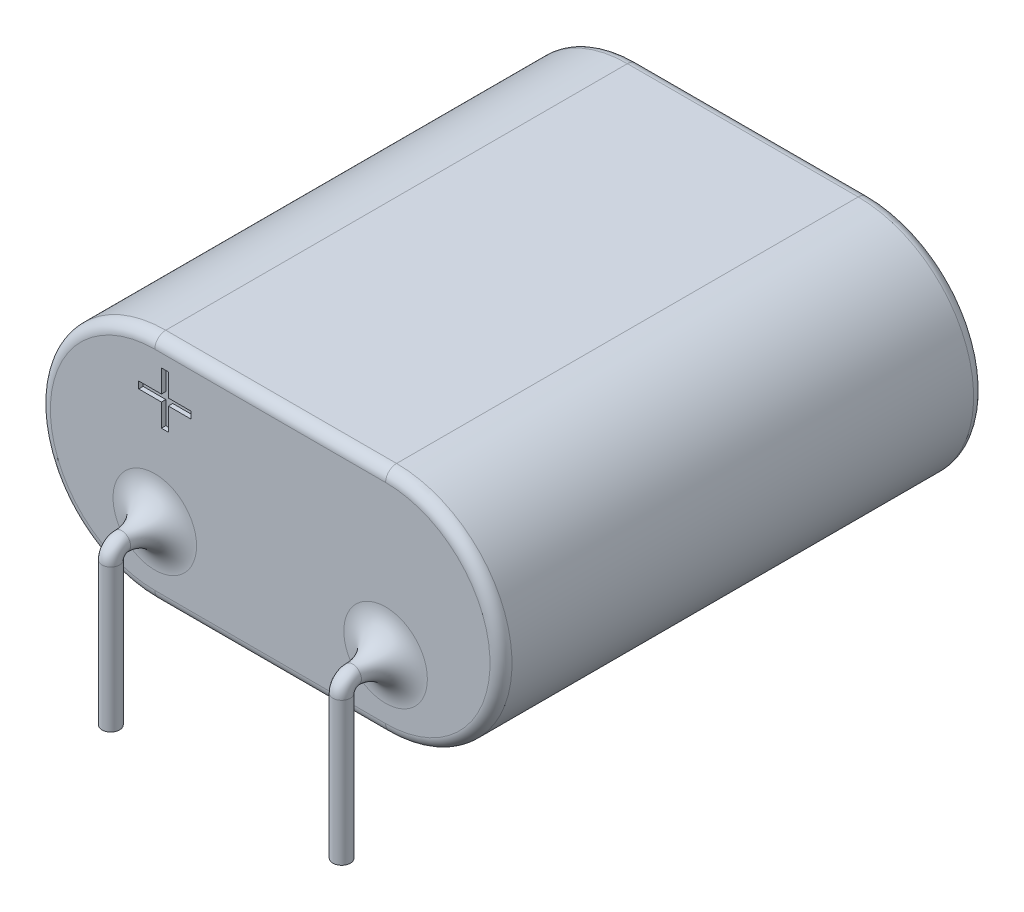
ISO-10303-21;
HEADER;
FILE_DESCRIPTION(('STEP AP214'),'2;1');
FILE_NAME('part.step','',(''),(''),'','','');
FILE_SCHEMA(('AUTOMOTIVE_DESIGN { 1 0 10303 214 1 1 1 1 }'));
ENDSEC;
DATA;
#1=APPLICATION_CONTEXT('core data for automotive mechanical design processes');
#2=APPLICATION_PROTOCOL_DEFINITION('international standard','automotive_design',2000,#1);
#3=PRODUCT_CONTEXT('',#1,'mechanical');
#4=PRODUCT('Part','Part','',(#3));
#5=PRODUCT_RELATED_PRODUCT_CATEGORY('part','',(#4));
#6=PRODUCT_DEFINITION_FORMATION('','',#4);
#7=PRODUCT_DEFINITION_CONTEXT('part definition',#1,'design');
#8=PRODUCT_DEFINITION('design','',#6,#7);
#9=PRODUCT_DEFINITION_SHAPE('','',#8);
#10=(LENGTH_UNIT() NAMED_UNIT(*) SI_UNIT(.MILLI.,.METRE.));
#11=(NAMED_UNIT(*) PLANE_ANGLE_UNIT() SI_UNIT($,.RADIAN.));
#12=(NAMED_UNIT(*) SI_UNIT($,.STERADIAN.) SOLID_ANGLE_UNIT());
#13=UNCERTAINTY_MEASURE_WITH_UNIT(LENGTH_MEASURE(1.E-05),#10,'distance_accuracy_value','');
#14=(GEOMETRIC_REPRESENTATION_CONTEXT(3) GLOBAL_UNCERTAINTY_ASSIGNED_CONTEXT((#13)) GLOBAL_UNIT_ASSIGNED_CONTEXT((#10,
#11,#12)) REPRESENTATION_CONTEXT('',''));
#15=CARTESIAN_POINT('',(0.,0.,0.));
#16=DIRECTION('',(0.,0.,1.));
#17=DIRECTION('',(1.,0.,0.));
#18=AXIS2_PLACEMENT_3D('',#15,#16,#17);
#19=CARTESIAN_POINT('',(0.,0.,0.));
#20=DIRECTION('',(0.,0.,1.));
#21=DIRECTION('',(1.,0.,0.));
#22=AXIS2_PLACEMENT_3D('',#19,#20,#21);
#23=PLANE('',#22);
#24=CARTESIAN_POINT('',(10.5,0.,0.));
#25=DIRECTION('',(0.,0.,1.));
#26=DIRECTION('',(1.,0.,0.));
#27=AXIS2_PLACEMENT_3D('',#24,#25,#26);
#28=CIRCLE('',#27,4.75);
#29=CARTESIAN_POINT('',(10.5,-4.75,0.));
#30=VERTEX_POINT('',#29);
#31=CARTESIAN_POINT('',(10.5,4.75,0.));
#32=VERTEX_POINT('',#31);
#33=EDGE_CURVE('E51',#30,#32,#28,.T.);
#34=ORIENTED_EDGE('',*,*,#33,.T.);
#35=DIRECTION('',(-1.,0.,0.));
#36=VECTOR('',#35,1.);
#37=CARTESIAN_POINT('',(0.,4.75,0.));
#38=LINE('',#37,#36);
#39=CARTESIAN_POINT('',(0.,4.75,0.));
#40=VERTEX_POINT('',#39);
#41=EDGE_CURVE('E11',#32,#40,#38,.T.);
#42=ORIENTED_EDGE('',*,*,#41,.T.);
#43=CARTESIAN_POINT('',(0.,0.,0.));
#44=DIRECTION('',(0.,0.,1.));
#45=DIRECTION('',(1.,0.,0.));
#46=AXIS2_PLACEMENT_3D('',#43,#44,#45);
#47=CIRCLE('',#46,4.75);
#48=CARTESIAN_POINT('',(0.,-4.75,0.));
#49=VERTEX_POINT('',#48);
#50=EDGE_CURVE('E303',#40,#49,#47,.T.);
#51=ORIENTED_EDGE('',*,*,#50,.T.);
#52=DIRECTION('',(1.,0.,0.));
#53=VECTOR('',#52,1.);
#54=CARTESIAN_POINT('',(0.,-4.75,0.));
#55=LINE('',#54,#53);
#56=EDGE_CURVE('E306',#49,#30,#55,.T.);
#57=ORIENTED_EDGE('',*,*,#56,.T.);
#58=EDGE_LOOP('',(#34,#42,#51,#57));
#59=FACE_BOUND('',#58,.T.);
#60=CARTESIAN_POINT('',(10.5,-2.05,0.));
#61=DIRECTION('',(0.,0.,1.));
#62=DIRECTION('',(1.,0.,0.));
#63=AXIS2_PLACEMENT_3D('',#60,#61,#62);
#64=CIRCLE('',#63,1.9);
#65=CARTESIAN_POINT('',(12.4,-2.05,0.));
#66=VERTEX_POINT('',#65);
#67=EDGE_CURVE('E260',#66,#66,#64,.F.);
#68=ORIENTED_EDGE('',*,*,#67,.T.);
#69=EDGE_LOOP('',(#68));
#70=FACE_BOUND('',#69,.T.);
#71=CARTESIAN_POINT('',(0.,-2.05,0.));
#72=DIRECTION('',(0.,0.,1.));
#73=DIRECTION('',(1.,0.,0.));
#74=AXIS2_PLACEMENT_3D('',#71,#72,#73);
#75=CIRCLE('',#74,1.9);
#76=CARTESIAN_POINT('',(1.9,-2.05,0.));
#77=VERTEX_POINT('',#76);
#78=EDGE_CURVE('E245',#77,#77,#75,.F.);
#79=ORIENTED_EDGE('',*,*,#78,.T.);
#80=EDGE_LOOP('',(#79));
#81=FACE_BOUND('',#80,.T.);
#82=DIRECTION('',(0.,1.,0.));
#83=VECTOR('',#82,1.);
#84=CARTESIAN_POINT('',(-0.73076923076923,2.82051282051282,0.));
#85=LINE('',#84,#83);
#86=CARTESIAN_POINT('',(-0.73076923076923,2.82051282051282,0.));
#87=VERTEX_POINT('',#86);
#88=CARTESIAN_POINT('',(-0.73076923076923,3.13461538461538,0.));
#89=VERTEX_POINT('',#88);
#90=EDGE_CURVE('E198',#87,#89,#85,.T.);
#91=ORIENTED_EDGE('',*,*,#90,.T.);
#92=DIRECTION('',(1.,0.,0.));
#93=VECTOR('',#92,1.);
#94=CARTESIAN_POINT('',(-0.73076923076923,3.13461538461538,0.));
#95=LINE('',#94,#93);
#96=CARTESIAN_POINT('',(0.301282051282052,3.13461538461538,0.));
#97=VERTEX_POINT('',#96);
#98=EDGE_CURVE('E59',#89,#97,#95,.T.);
#99=ORIENTED_EDGE('',*,*,#98,.T.);
#100=DIRECTION('',(0.,1.,0.));
#101=VECTOR('',#100,1.);
#102=CARTESIAN_POINT('',(0.301282051282052,3.13461538461538,0.));
#103=LINE('',#102,#101);
#104=CARTESIAN_POINT('',(0.301282051282052,4.16666666666667,0.));
#105=VERTEX_POINT('',#104);
#106=EDGE_CURVE('E202',#97,#105,#103,.T.);
#107=ORIENTED_EDGE('',*,*,#106,.T.);
#108=DIRECTION('',(1.,0.,0.));
#109=VECTOR('',#108,1.);
#110=CARTESIAN_POINT('',(0.301282051282052,4.16666666666667,0.));
#111=LINE('',#110,#109);
#112=CARTESIAN_POINT('',(0.615384615384616,4.16666666666667,0.));
#113=VERTEX_POINT('',#112);
#114=EDGE_CURVE('E724',#105,#113,#111,.T.);
#115=ORIENTED_EDGE('',*,*,#114,.T.);
#116=DIRECTION('',(0.,-1.,0.));
#117=VECTOR('',#116,1.);
#118=CARTESIAN_POINT('',(0.615384615384616,4.16666666666667,0.));
#119=LINE('',#118,#117);
#120=CARTESIAN_POINT('',(0.615384615384616,3.13461538461538,0.));
#121=VERTEX_POINT('',#120);
#122=EDGE_CURVE('E726',#113,#121,#119,.T.);
#123=ORIENTED_EDGE('',*,*,#122,.T.);
#124=DIRECTION('',(1.,0.,0.));
#125=VECTOR('',#124,1.);
#126=CARTESIAN_POINT('',(0.615384615384616,3.13461538461538,0.));
#127=LINE('',#126,#125);
#128=CARTESIAN_POINT('',(1.6474358974359,3.13461538461538,0.));
#129=VERTEX_POINT('',#128);
#130=EDGE_CURVE('E731',#121,#129,#127,.T.);
#131=ORIENTED_EDGE('',*,*,#130,.T.);
#132=DIRECTION('',(0.,-1.,0.));
#133=VECTOR('',#132,1.);
#134=CARTESIAN_POINT('',(1.6474358974359,3.13461538461538,0.));
#135=LINE('',#134,#133);
#136=CARTESIAN_POINT('',(1.6474358974359,2.82051282051282,0.));
#137=VERTEX_POINT('',#136);
#138=EDGE_CURVE('E741',#129,#137,#135,.T.);
#139=ORIENTED_EDGE('',*,*,#138,.T.);
#140=DIRECTION('',(-1.,0.,0.));
#141=VECTOR('',#140,1.);
#142=CARTESIAN_POINT('',(1.6474358974359,2.82051282051282,0.));
#143=LINE('',#142,#141);
#144=CARTESIAN_POINT('',(0.615384615384616,2.82051282051282,0.));
#145=VERTEX_POINT('',#144);
#146=EDGE_CURVE('E745',#137,#145,#143,.T.);
#147=ORIENTED_EDGE('',*,*,#146,.T.);
#148=DIRECTION('',(0.,-1.,0.));
#149=VECTOR('',#148,1.);
#150=CARTESIAN_POINT('',(0.615384615384616,2.82051282051282,0.));
#151=LINE('',#150,#149);
#152=CARTESIAN_POINT('',(0.615384615384616,1.78846153846154,0.));
#153=VERTEX_POINT('',#152);
#154=EDGE_CURVE('E749',#145,#153,#151,.T.);
#155=ORIENTED_EDGE('',*,*,#154,.T.);
#156=DIRECTION('',(-1.,0.,0.));
#157=VECTOR('',#156,1.);
#158=CARTESIAN_POINT('',(0.615384615384616,1.78846153846154,0.));
#159=LINE('',#158,#157);
#160=CARTESIAN_POINT('',(0.301282051282052,1.78846153846154,0.));
#161=VERTEX_POINT('',#160);
#162=EDGE_CURVE('E690',#153,#161,#159,.T.);
#163=ORIENTED_EDGE('',*,*,#162,.T.);
#164=DIRECTION('',(0.,1.,0.));
#165=VECTOR('',#164,1.);
#166=CARTESIAN_POINT('',(0.301282051282052,1.78846153846154,0.));
#167=LINE('',#166,#165);
#168=CARTESIAN_POINT('',(0.301282051282052,2.82051282051282,0.));
#169=VERTEX_POINT('',#168);
#170=EDGE_CURVE('E685',#161,#169,#167,.T.);
#171=ORIENTED_EDGE('',*,*,#170,.T.);
#172=DIRECTION('',(-1.,0.,0.));
#173=VECTOR('',#172,1.);
#174=CARTESIAN_POINT('',(0.301282051282052,2.82051282051282,0.));
#175=LINE('',#174,#173);
#176=EDGE_CURVE('E679',#169,#87,#175,.T.);
#177=ORIENTED_EDGE('',*,*,#176,.T.);
#178=EDGE_LOOP('',(#91,#99,#107,#115,#123,#131,#139,#147,#155,#163,#171,#177));
#179=FACE_BOUND('',#178,.T.);
#180=ADVANCED_FACE('F41',(#59,#70,#81,#179),#23,.T.);
#181=CARTESIAN_POINT('',(0.,0.,-22.));
#182=DIRECTION('',(0.,0.,1.));
#183=DIRECTION('',(1.,0.,0.));
#184=AXIS2_PLACEMENT_3D('',#181,#182,#183);
#185=CYLINDRICAL_SURFACE('',#184,5.25);
#186=DIRECTION('',(0.,0.,1.));
#187=VECTOR('',#186,1.);
#188=CARTESIAN_POINT('',(0.,5.25,-22.));
#189=LINE('',#188,#187);
#190=CARTESIAN_POINT('',(0.,5.25,-21.5));
#191=VERTEX_POINT('',#190);
#192=CARTESIAN_POINT('',(0.,5.25,-0.5));
#193=VERTEX_POINT('',#192);
#194=EDGE_CURVE('E241',#191,#193,#189,.T.);
#195=ORIENTED_EDGE('',*,*,#194,.F.);
#196=CARTESIAN_POINT('',(0.,0.,-21.5));
#197=DIRECTION('',(0.,0.,1.));
#198=DIRECTION('',(1.,0.,0.));
#199=AXIS2_PLACEMENT_3D('',#196,#197,#198);
#200=CIRCLE('',#199,5.25);
#201=CARTESIAN_POINT('',(0.,-5.25,-21.5));
#202=VERTEX_POINT('',#201);
#203=EDGE_CURVE('E300',#191,#202,#200,.T.);
#204=ORIENTED_EDGE('',*,*,#203,.T.);
#205=DIRECTION('',(0.,0.,1.));
#206=VECTOR('',#205,1.);
#207=CARTESIAN_POINT('',(0.,-5.25,-22.));
#208=LINE('',#207,#206);
#209=CARTESIAN_POINT('',(0.,-5.25,-0.5));
#210=VERTEX_POINT('',#209);
#211=EDGE_CURVE('E240',#202,#210,#208,.T.);
#212=ORIENTED_EDGE('',*,*,#211,.T.);
#213=CARTESIAN_POINT('',(0.,0.,-0.5));
#214=DIRECTION('',(0.,0.,1.));
#215=DIRECTION('',(1.,0.,0.));
#216=AXIS2_PLACEMENT_3D('',#213,#214,#215);
#217=CIRCLE('',#216,5.25);
#218=EDGE_CURVE('E297',#210,#193,#217,.F.);
#219=ORIENTED_EDGE('',*,*,#218,.T.);
#220=EDGE_LOOP('',(#195,#204,#212,#219));
#221=FACE_BOUND('',#220,.T.);
#222=ADVANCED_FACE('F348',(#221),#185,.T.);
#223=CARTESIAN_POINT('',(0.,5.25,-22.));
#224=DIRECTION('',(0.,1.,0.));
#225=DIRECTION('',(-1.,0.,0.));
#226=AXIS2_PLACEMENT_3D('',#223,#224,#225);
#227=PLANE('',#226);
#228=DIRECTION('',(0.,0.,1.));
#229=VECTOR('',#228,1.);
#230=CARTESIAN_POINT('',(10.5,5.25,-22.));
#231=LINE('',#230,#229);
#232=CARTESIAN_POINT('',(10.5,5.25,-21.5));
#233=VERTEX_POINT('',#232);
#234=CARTESIAN_POINT('',(10.5,5.25,-0.5));
#235=VERTEX_POINT('',#234);
#236=EDGE_CURVE('E246',#233,#235,#231,.T.);
#237=ORIENTED_EDGE('',*,*,#236,.F.);
#238=DIRECTION('',(-1.,0.,0.));
#239=VECTOR('',#238,1.);
#240=CARTESIAN_POINT('',(0.,5.25,-21.5));
#241=LINE('',#240,#239);
#242=EDGE_CURVE('E294',#233,#191,#241,.T.);
#243=ORIENTED_EDGE('',*,*,#242,.T.);
#244=ORIENTED_EDGE('',*,*,#194,.T.);
#245=DIRECTION('',(-1.,0.,0.));
#246=VECTOR('',#245,1.);
#247=CARTESIAN_POINT('',(0.,5.25,-0.5));
#248=LINE('',#247,#246);
#249=EDGE_CURVE('E290',#193,#235,#248,.F.);
#250=ORIENTED_EDGE('',*,*,#249,.T.);
#251=EDGE_LOOP('',(#237,#243,#244,#250));
#252=FACE_BOUND('',#251,.T.);
#253=ADVANCED_FACE('F365',(#252),#227,.T.);
#254=CARTESIAN_POINT('',(10.5,0.,-22.));
#255=DIRECTION('',(0.,0.,1.));
#256=DIRECTION('',(1.,0.,0.));
#257=AXIS2_PLACEMENT_3D('',#254,#255,#256);
#258=CYLINDRICAL_SURFACE('',#257,5.25);
#259=DIRECTION('',(0.,0.,1.));
#260=VECTOR('',#259,1.);
#261=CARTESIAN_POINT('',(10.5,-5.25,-22.));
#262=LINE('',#261,#260);
#263=CARTESIAN_POINT('',(10.5,-5.25,-21.5));
#264=VERTEX_POINT('',#263);
#265=CARTESIAN_POINT('',(10.5,-5.25,-0.5));
#266=VERTEX_POINT('',#265);
#267=EDGE_CURVE('E250',#264,#266,#262,.T.);
#268=ORIENTED_EDGE('',*,*,#267,.F.);
#269=CARTESIAN_POINT('',(10.5,0.,-21.5));
#270=DIRECTION('',(0.,0.,1.));
#271=DIRECTION('',(1.,0.,0.));
#272=AXIS2_PLACEMENT_3D('',#269,#270,#271);
#273=CIRCLE('',#272,5.25);
#274=EDGE_CURVE('E287',#264,#233,#273,.T.);
#275=ORIENTED_EDGE('',*,*,#274,.T.);
#276=ORIENTED_EDGE('',*,*,#236,.T.);
#277=CARTESIAN_POINT('',(10.5,0.,-0.5));
#278=DIRECTION('',(0.,0.,1.));
#279=DIRECTION('',(1.,0.,0.));
#280=AXIS2_PLACEMENT_3D('',#277,#278,#279);
#281=CIRCLE('',#280,5.25);
#282=EDGE_CURVE('E284',#235,#266,#281,.F.);
#283=ORIENTED_EDGE('',*,*,#282,.T.);
#284=EDGE_LOOP('',(#268,#275,#276,#283));
#285=FACE_BOUND('',#284,.T.);
#286=ADVANCED_FACE('F361',(#285),#258,.T.);
#287=CARTESIAN_POINT('',(0.,-5.25,-22.));
#288=DIRECTION('',(0.,-1.,0.));
#289=DIRECTION('',(1.,0.,0.));
#290=AXIS2_PLACEMENT_3D('',#287,#288,#289);
#291=PLANE('',#290);
#292=ORIENTED_EDGE('',*,*,#211,.F.);
#293=DIRECTION('',(1.,0.,0.));
#294=VECTOR('',#293,1.);
#295=CARTESIAN_POINT('',(10.5,-5.25,-21.5));
#296=LINE('',#295,#294);
#297=EDGE_CURVE('E267',#202,#264,#296,.T.);
#298=ORIENTED_EDGE('',*,*,#297,.T.);
#299=ORIENTED_EDGE('',*,*,#267,.T.);
#300=DIRECTION('',(1.,0.,0.));
#301=VECTOR('',#300,1.);
#302=CARTESIAN_POINT('',(0.,-5.25,-0.5));
#303=LINE('',#302,#301);
#304=EDGE_CURVE('E264',#266,#210,#303,.F.);
#305=ORIENTED_EDGE('',*,*,#304,.T.);
#306=EDGE_LOOP('',(#292,#298,#299,#305));
#307=FACE_BOUND('',#306,.T.);
#308=ADVANCED_FACE('F343',(#307),#291,.T.);
#309=CARTESIAN_POINT('',(0.,0.,-22.));
#310=DIRECTION('',(0.,0.,1.));
#311=DIRECTION('',(1.,0.,0.));
#312=AXIS2_PLACEMENT_3D('',#309,#310,#311);
#313=PLANE('',#312);
#314=CARTESIAN_POINT('',(10.5,0.,-22.));
#315=DIRECTION('',(0.,0.,1.));
#316=DIRECTION('',(1.,0.,0.));
#317=AXIS2_PLACEMENT_3D('',#314,#315,#316);
#318=CIRCLE('',#317,4.75);
#319=CARTESIAN_POINT('',(10.5,4.75,-22.));
#320=VERTEX_POINT('',#319);
#321=CARTESIAN_POINT('',(10.5,-4.75,-22.));
#322=VERTEX_POINT('',#321);
#323=EDGE_CURVE('E277',#320,#322,#318,.F.);
#324=ORIENTED_EDGE('',*,*,#323,.T.);
#325=DIRECTION('',(1.,0.,0.));
#326=VECTOR('',#325,1.);
#327=CARTESIAN_POINT('',(0.,-4.75,-22.));
#328=LINE('',#327,#326);
#329=CARTESIAN_POINT('',(0.,-4.75,-22.));
#330=VERTEX_POINT('',#329);
#331=EDGE_CURVE('E280',#322,#330,#328,.F.);
#332=ORIENTED_EDGE('',*,*,#331,.T.);
#333=CARTESIAN_POINT('',(0.,0.,-22.));
#334=DIRECTION('',(0.,0.,1.));
#335=DIRECTION('',(1.,0.,0.));
#336=AXIS2_PLACEMENT_3D('',#333,#334,#335);
#337=CIRCLE('',#336,4.75);
#338=CARTESIAN_POINT('',(0.,4.75,-22.));
#339=VERTEX_POINT('',#338);
#340=EDGE_CURVE('E271',#330,#339,#337,.F.);
#341=ORIENTED_EDGE('',*,*,#340,.T.);
#342=DIRECTION('',(-1.,0.,0.));
#343=VECTOR('',#342,1.);
#344=CARTESIAN_POINT('',(10.5,4.75,-22.));
#345=LINE('',#344,#343);
#346=EDGE_CURVE('E274',#339,#320,#345,.F.);
#347=ORIENTED_EDGE('',*,*,#346,.T.);
#348=EDGE_LOOP('',(#324,#332,#341,#347));
#349=FACE_BOUND('',#348,.T.);
#350=ADVANCED_FACE('F375',(#349),#313,.F.);
#351=CARTESIAN_POINT('',(0.,-9.05,2.));
#352=DIRECTION('',(0.,-1.,0.));
#353=DIRECTION('',(1.,0.,0.));
#354=AXIS2_PLACEMENT_3D('',#351,#352,#353);
#355=PLANE('',#354);
#356=CARTESIAN_POINT('',(0.,-9.05,2.));
#357=DIRECTION('',(0.,-1.,0.));
#358=DIRECTION('',(1.,0.,0.));
#359=AXIS2_PLACEMENT_3D('',#356,#357,#358);
#360=CIRCLE('',#359,0.4);
#361=CARTESIAN_POINT('',(0.4,-9.05,2.));
#362=VERTEX_POINT('',#361);
#363=EDGE_CURVE('E236',#362,#362,#360,.T.);
#364=ORIENTED_EDGE('',*,*,#363,.T.);
#365=EDGE_LOOP('',(#364));
#366=FACE_BOUND('',#365,.T.);
#367=ADVANCED_FACE('F377',(#366),#355,.T.);
#368=CARTESIAN_POINT('',(0.,-2.55,1.5));
#369=DIRECTION('',(1.,0.,0.));
#370=DIRECTION('',(0.,0.,-1.));
#371=AXIS2_PLACEMENT_3D('',#368,#369,#370);
#372=TOROIDAL_SURFACE('',#371,0.5,0.4);
#373=CARTESIAN_POINT('',(0.,-2.05,1.5));
#374=DIRECTION('',(0.,0.,1.));
#375=DIRECTION('',(1.,0.,0.));
#376=AXIS2_PLACEMENT_3D('',#373,#374,#375);
#377=CIRCLE('',#376,0.4);
#378=CARTESIAN_POINT('',(0.,-1.65,1.49999999999999));
#379=VERTEX_POINT('',#378);
#380=EDGE_CURVE('E228',#379,#379,#377,.T.);
#381=CARTESIAN_POINT('',(0.,-2.55,2.));
#382=DIRECTION('',(0.,-1.,0.));
#383=DIRECTION('',(1.,0.,0.));
#384=AXIS2_PLACEMENT_3D('',#381,#382,#383);
#385=CIRCLE('',#384,0.4);
#386=CARTESIAN_POINT('',(0.,-2.55000000000001,2.4));
#387=VERTEX_POINT('',#386);
#388=EDGE_CURVE('E232',#387,#387,#385,.T.);
#389=CARTESIAN_POINT('',(0.,-2.55,1.5));
#390=DIRECTION('',(1.,0.,0.));
#391=DIRECTION('',(0.,0.,-1.));
#392=AXIS2_PLACEMENT_3D('',#389,#390,#391);
#393=CIRCLE('',#392,0.9);
#394=EDGE_CURVE('',#379,#387,#393,.T.);
#395=ORIENTED_EDGE('',*,*,#380,.T.);
#396=ORIENTED_EDGE('',*,*,#388,.F.);
#397=ORIENTED_EDGE('',*,*,#394,.T.);
#398=ORIENTED_EDGE('',*,*,#394,.F.);
#399=EDGE_LOOP('',(#395,#397,#396,#398));
#400=FACE_BOUND('',#399,.T.);
#401=ADVANCED_FACE('F384',(#400),#372,.T.);
#402=CARTESIAN_POINT('',(0.,-2.55,2.));
#403=DIRECTION('',(0.,-1.,0.));
#404=DIRECTION('',(0.,0.,-1.));
#405=AXIS2_PLACEMENT_3D('',#402,#403,#404);
#406=CYLINDRICAL_SURFACE('',#405,0.4);
#407=ORIENTED_EDGE('',*,*,#363,.F.);
#408=EDGE_LOOP('',(#407));
#409=FACE_BOUND('',#408,.T.);
#410=ORIENTED_EDGE('',*,*,#388,.T.);
#411=EDGE_LOOP('',(#410));
#412=FACE_BOUND('',#411,.T.);
#413=ADVANCED_FACE('F379',(#409,#412),#406,.T.);
#414=CARTESIAN_POINT('',(10.5,-9.05,2.));
#415=DIRECTION('',(0.,-1.,0.));
#416=DIRECTION('',(1.,0.,0.));
#417=AXIS2_PLACEMENT_3D('',#414,#415,#416);
#418=PLANE('',#417);
#419=CARTESIAN_POINT('',(10.5,-9.05,2.));
#420=DIRECTION('',(0.,-1.,0.));
#421=DIRECTION('',(1.,0.,0.));
#422=AXIS2_PLACEMENT_3D('',#419,#420,#421);
#423=CIRCLE('',#422,0.399999999999999);
#424=CARTESIAN_POINT('',(10.9,-9.05,2.));
#425=VERTEX_POINT('',#424);
#426=EDGE_CURVE('E224',#425,#425,#423,.T.);
#427=ORIENTED_EDGE('',*,*,#426,.T.);
#428=EDGE_LOOP('',(#427));
#429=FACE_BOUND('',#428,.T.);
#430=ADVANCED_FACE('F391',(#429),#418,.T.);
#431=CARTESIAN_POINT('',(10.5,-2.55,1.5));
#432=DIRECTION('',(1.,0.,0.));
#433=DIRECTION('',(0.,0.,-1.));
#434=AXIS2_PLACEMENT_3D('',#431,#432,#433);
#435=TOROIDAL_SURFACE('',#434,0.5,0.399999999999999);
#436=CARTESIAN_POINT('',(10.5,-2.05,1.5));
#437=DIRECTION('',(0.,0.,1.));
#438=DIRECTION('',(1.,0.,0.));
#439=AXIS2_PLACEMENT_3D('',#436,#437,#438);
#440=CIRCLE('',#439,0.399999999999999);
#441=CARTESIAN_POINT('',(10.5,-1.65,1.49999999999999));
#442=VERTEX_POINT('',#441);
#443=EDGE_CURVE('E215',#442,#442,#440,.T.);
#444=CARTESIAN_POINT('',(10.5,-2.55,2.));
#445=DIRECTION('',(0.,-1.,0.));
#446=DIRECTION('',(1.,0.,0.));
#447=AXIS2_PLACEMENT_3D('',#444,#445,#446);
#448=CIRCLE('',#447,0.399999999999999);
#449=CARTESIAN_POINT('',(10.5,-2.55000000000001,2.4));
#450=VERTEX_POINT('',#449);
#451=EDGE_CURVE('E219',#450,#450,#448,.T.);
#452=CARTESIAN_POINT('',(10.5,-2.55,1.5));
#453=DIRECTION('',(1.,0.,0.));
#454=DIRECTION('',(0.,0.,-1.));
#455=AXIS2_PLACEMENT_3D('',#452,#453,#454);
#456=CIRCLE('',#455,0.9);
#457=EDGE_CURVE('',#442,#450,#456,.T.);
#458=ORIENTED_EDGE('',*,*,#443,.T.);
#459=ORIENTED_EDGE('',*,*,#451,.F.);
#460=ORIENTED_EDGE('',*,*,#457,.T.);
#461=ORIENTED_EDGE('',*,*,#457,.F.);
#462=EDGE_LOOP('',(#458,#460,#459,#461));
#463=FACE_BOUND('',#462,.T.);
#464=ADVANCED_FACE('F464',(#463),#435,.T.);
#465=CARTESIAN_POINT('',(10.5,-2.55,2.));
#466=DIRECTION('',(0.,-1.,0.));
#467=DIRECTION('',(0.,0.,-1.));
#468=AXIS2_PLACEMENT_3D('',#465,#466,#467);
#469=CYLINDRICAL_SURFACE('',#468,0.399999999999999);
#470=ORIENTED_EDGE('',*,*,#426,.F.);
#471=EDGE_LOOP('',(#470));
#472=FACE_BOUND('',#471,.T.);
#473=ORIENTED_EDGE('',*,*,#451,.T.);
#474=EDGE_LOOP('',(#473));
#475=FACE_BOUND('',#474,.T.);
#476=ADVANCED_FACE('F387',(#472,#475),#469,.T.);
#477=CARTESIAN_POINT('',(10.5,-2.05,1.5));
#478=DIRECTION('',(0.,0.,1.));
#479=DIRECTION('',(1.,0.,0.));
#480=AXIS2_PLACEMENT_3D('',#477,#478,#479);
#481=TOROIDAL_SURFACE('',#480,1.9,1.5);
#482=ORIENTED_EDGE('',*,*,#67,.F.);
#483=EDGE_LOOP('',(#482));
#484=FACE_BOUND('',#483,.T.);
#485=ORIENTED_EDGE('',*,*,#443,.F.);
#486=EDGE_LOOP('',(#485));
#487=FACE_BOUND('',#486,.T.);
#488=ADVANCED_FACE('F405',(#484,#487),#481,.F.);
#489=CARTESIAN_POINT('',(0.,-2.05,1.5));
#490=DIRECTION('',(0.,0.,1.));
#491=DIRECTION('',(1.,0.,0.));
#492=AXIS2_PLACEMENT_3D('',#489,#490,#491);
#493=TOROIDAL_SURFACE('',#492,1.9,1.5);
#494=ORIENTED_EDGE('',*,*,#78,.F.);
#495=EDGE_LOOP('',(#494));
#496=FACE_BOUND('',#495,.T.);
#497=ORIENTED_EDGE('',*,*,#380,.F.);
#498=EDGE_LOOP('',(#497));
#499=FACE_BOUND('',#498,.T.);
#500=ADVANCED_FACE('F408',(#496,#499),#493,.F.);
#501=CARTESIAN_POINT('',(0.,4.75,-21.5));
#502=DIRECTION('',(1.,0.,0.));
#503=DIRECTION('',(0.,1.,0.));
#504=AXIS2_PLACEMENT_3D('',#501,#502,#503);
#505=CYLINDRICAL_SURFACE('',#504,0.5);
#506=CARTESIAN_POINT('',(10.5,4.75,-21.5));
#507=DIRECTION('',(1.,0.,0.));
#508=DIRECTION('',(0.,0.,-1.));
#509=AXIS2_PLACEMENT_3D('',#506,#507,#508);
#510=CIRCLE('',#509,0.5);
#511=EDGE_CURVE('E317',#320,#233,#510,.T.);
#512=ORIENTED_EDGE('',*,*,#511,.F.);
#513=ORIENTED_EDGE('',*,*,#346,.F.);
#514=CARTESIAN_POINT('',(0.,4.75,-21.5));
#515=DIRECTION('',(-1.,0.,0.));
#516=DIRECTION('',(0.,-1.,0.));
#517=AXIS2_PLACEMENT_3D('',#514,#515,#516);
#518=CIRCLE('',#517,0.5);
#519=EDGE_CURVE('E220',#191,#339,#518,.T.);
#520=ORIENTED_EDGE('',*,*,#519,.F.);
#521=ORIENTED_EDGE('',*,*,#242,.F.);
#522=EDGE_LOOP('',(#512,#513,#520,#521));
#523=FACE_BOUND('',#522,.T.);
#524=ADVANCED_FACE('F369',(#523),#505,.T.);
#525=CARTESIAN_POINT('',(0.,0.,-21.5));
#526=DIRECTION('',(0.,0.,1.));
#527=DIRECTION('',(1.,0.,0.));
#528=AXIS2_PLACEMENT_3D('',#525,#526,#527);
#529=TOROIDAL_SURFACE('',#528,4.75,0.5);
#530=ORIENTED_EDGE('',*,*,#519,.T.);
#531=ORIENTED_EDGE('',*,*,#340,.F.);
#532=CARTESIAN_POINT('',(0.,-4.75,-21.5));
#533=DIRECTION('',(1.,0.,0.));
#534=DIRECTION('',(0.,0.,-1.));
#535=AXIS2_PLACEMENT_3D('',#532,#533,#534);
#536=CIRCLE('',#535,0.5);
#537=EDGE_CURVE('E314',#202,#330,#536,.T.);
#538=ORIENTED_EDGE('',*,*,#537,.F.);
#539=ORIENTED_EDGE('',*,*,#203,.F.);
#540=EDGE_LOOP('',(#530,#531,#538,#539));
#541=FACE_BOUND('',#540,.T.);
#542=ADVANCED_FACE('F352',(#541),#529,.T.);
#543=CARTESIAN_POINT('',(10.5,0.,-21.5));
#544=DIRECTION('',(0.,0.,1.));
#545=DIRECTION('',(1.,0.,0.));
#546=AXIS2_PLACEMENT_3D('',#543,#544,#545);
#547=TOROIDAL_SURFACE('',#546,4.75,0.5);
#548=ORIENTED_EDGE('',*,*,#511,.T.);
#549=ORIENTED_EDGE('',*,*,#274,.F.);
#550=CARTESIAN_POINT('',(10.5,-4.75,-21.5));
#551=DIRECTION('',(-1.,0.,0.));
#552=DIRECTION('',(0.,0.,1.));
#553=AXIS2_PLACEMENT_3D('',#550,#551,#552);
#554=CIRCLE('',#553,0.5);
#555=EDGE_CURVE('E311',#322,#264,#554,.T.);
#556=ORIENTED_EDGE('',*,*,#555,.F.);
#557=ORIENTED_EDGE('',*,*,#323,.F.);
#558=EDGE_LOOP('',(#548,#549,#556,#557));
#559=FACE_BOUND('',#558,.T.);
#560=ADVANCED_FACE('F373',(#559),#547,.T.);
#561=CARTESIAN_POINT('',(0.,-4.75,-21.5));
#562=DIRECTION('',(-1.,0.,0.));
#563=DIRECTION('',(0.,-1.,0.));
#564=AXIS2_PLACEMENT_3D('',#561,#562,#563);
#565=CYLINDRICAL_SURFACE('',#564,0.5);
#566=ORIENTED_EDGE('',*,*,#537,.T.);
#567=ORIENTED_EDGE('',*,*,#331,.F.);
#568=ORIENTED_EDGE('',*,*,#555,.T.);
#569=ORIENTED_EDGE('',*,*,#297,.F.);
#570=EDGE_LOOP('',(#566,#567,#568,#569));
#571=FACE_BOUND('',#570,.T.);
#572=ADVANCED_FACE('F357',(#571),#565,.T.);
#573=CARTESIAN_POINT('',(0.,-4.75,-0.5));
#574=DIRECTION('',(1.,0.,0.));
#575=DIRECTION('',(0.,1.,0.));
#576=AXIS2_PLACEMENT_3D('',#573,#574,#575);
#577=CYLINDRICAL_SURFACE('',#576,0.5);
#578=CARTESIAN_POINT('',(0.,-4.75,-0.5));
#579=DIRECTION('',(-1.,0.,0.));
#580=DIRECTION('',(0.,-1.,0.));
#581=AXIS2_PLACEMENT_3D('',#578,#579,#580);
#582=CIRCLE('',#581,0.5);
#583=EDGE_CURVE('E325',#210,#49,#582,.T.);
#584=ORIENTED_EDGE('',*,*,#583,.F.);
#585=ORIENTED_EDGE('',*,*,#304,.F.);
#586=CARTESIAN_POINT('',(10.5,-4.75,-0.5));
#587=DIRECTION('',(1.,0.,0.));
#588=DIRECTION('',(0.,0.,-1.));
#589=AXIS2_PLACEMENT_3D('',#586,#587,#588);
#590=CIRCLE('',#589,0.5);
#591=EDGE_CURVE('E45',#30,#266,#590,.T.);
#592=ORIENTED_EDGE('',*,*,#591,.F.);
#593=ORIENTED_EDGE('',*,*,#56,.F.);
#594=EDGE_LOOP('',(#584,#585,#592,#593));
#595=FACE_BOUND('',#594,.T.);
#596=ADVANCED_FACE('F43',(#595),#577,.T.);
#597=CARTESIAN_POINT('',(10.5,0.,-0.5));
#598=DIRECTION('',(0.,0.,1.));
#599=DIRECTION('',(1.,0.,0.));
#600=AXIS2_PLACEMENT_3D('',#597,#598,#599);
#601=TOROIDAL_SURFACE('',#600,4.75,0.5);
#602=ORIENTED_EDGE('',*,*,#591,.T.);
#603=ORIENTED_EDGE('',*,*,#282,.F.);
#604=CARTESIAN_POINT('',(10.5,4.75,-0.5));
#605=DIRECTION('',(-1.,0.,0.));
#606=DIRECTION('',(0.,0.,1.));
#607=AXIS2_PLACEMENT_3D('',#604,#605,#606);
#608=CIRCLE('',#607,0.5);
#609=EDGE_CURVE('E209',#32,#235,#608,.T.);
#610=ORIENTED_EDGE('',*,*,#609,.F.);
#611=ORIENTED_EDGE('',*,*,#33,.F.);
#612=EDGE_LOOP('',(#602,#603,#610,#611));
#613=FACE_BOUND('',#612,.T.);
#614=ADVANCED_FACE('F337',(#613),#601,.T.);
#615=CARTESIAN_POINT('',(0.,0.,-0.5));
#616=DIRECTION('',(0.,0.,1.));
#617=DIRECTION('',(1.,0.,0.));
#618=AXIS2_PLACEMENT_3D('',#615,#616,#617);
#619=TOROIDAL_SURFACE('',#618,4.75,0.5);
#620=ORIENTED_EDGE('',*,*,#583,.T.);
#621=ORIENTED_EDGE('',*,*,#50,.F.);
#622=CARTESIAN_POINT('',(0.,4.75,-0.5));
#623=DIRECTION('',(1.,0.,0.));
#624=DIRECTION('',(0.,0.,-1.));
#625=AXIS2_PLACEMENT_3D('',#622,#623,#624);
#626=CIRCLE('',#625,0.5);
#627=EDGE_CURVE('E204',#193,#40,#626,.T.);
#628=ORIENTED_EDGE('',*,*,#627,.F.);
#629=ORIENTED_EDGE('',*,*,#218,.F.);
#630=EDGE_LOOP('',(#620,#621,#628,#629));
#631=FACE_BOUND('',#630,.T.);
#632=ADVANCED_FACE('F424',(#631),#619,.T.);
#633=CARTESIAN_POINT('',(0.,4.75,-0.5));
#634=DIRECTION('',(-1.,0.,0.));
#635=DIRECTION('',(0.,-1.,0.));
#636=AXIS2_PLACEMENT_3D('',#633,#634,#635);
#637=CYLINDRICAL_SURFACE('',#636,0.5);
#638=ORIENTED_EDGE('',*,*,#609,.T.);
#639=ORIENTED_EDGE('',*,*,#249,.F.);
#640=ORIENTED_EDGE('',*,*,#627,.T.);
#641=ORIENTED_EDGE('',*,*,#41,.F.);
#642=EDGE_LOOP('',(#638,#639,#640,#641));
#643=FACE_BOUND('',#642,.T.);
#644=ADVANCED_FACE('F421',(#643),#637,.T.);
#645=CARTESIAN_POINT('',(-0.73076923076923,3.13461538461538,-0.2));
#646=DIRECTION('',(0.,-1.,0.));
#647=DIRECTION('',(0.,0.,-1.));
#648=AXIS2_PLACEMENT_3D('',#645,#646,#647);
#649=PLANE('',#648);
#650=ORIENTED_EDGE('',*,*,#98,.F.);
#651=DIRECTION('',(0.,0.,1.));
#652=VECTOR('',#651,1.);
#653=CARTESIAN_POINT('',(-0.73076923076923,3.13461538461538,-0.2));
#654=LINE('',#653,#652);
#655=CARTESIAN_POINT('',(-0.73076923076923,3.13461538461538,-0.2));
#656=VERTEX_POINT('',#655);
#657=EDGE_CURVE('E196',#656,#89,#654,.T.);
#658=ORIENTED_EDGE('',*,*,#657,.F.);
#659=DIRECTION('',(1.,0.,0.));
#660=VECTOR('',#659,1.);
#661=CARTESIAN_POINT('',(-0.73076923076923,3.13461538461538,-0.2));
#662=LINE('',#661,#660);
#663=CARTESIAN_POINT('',(0.301282051282052,3.13461538461538,-0.2));
#664=VERTEX_POINT('',#663);
#665=EDGE_CURVE('E186',#656,#664,#662,.T.);
#666=ORIENTED_EDGE('',*,*,#665,.T.);
#667=DIRECTION('',(0.,0.,1.));
#668=VECTOR('',#667,1.);
#669=CARTESIAN_POINT('',(0.301282051282052,3.13461538461538,-0.2));
#670=LINE('',#669,#668);
#671=EDGE_CURVE('E195',#664,#97,#670,.T.);
#672=ORIENTED_EDGE('',*,*,#671,.T.);
#673=EDGE_LOOP('',(#650,#658,#666,#672));
#674=FACE_BOUND('',#673,.T.);
#675=ADVANCED_FACE('F194',(#674),#649,.T.);
#676=CARTESIAN_POINT('',(0.301282051282052,3.13461538461538,-0.2));
#677=DIRECTION('',(1.,0.,0.));
#678=DIRECTION('',(0.,0.,-1.));
#679=AXIS2_PLACEMENT_3D('',#676,#677,#678);
#680=PLANE('',#679);
#681=ORIENTED_EDGE('',*,*,#106,.F.);
#682=ORIENTED_EDGE('',*,*,#671,.F.);
#683=DIRECTION('',(0.,1.,0.));
#684=VECTOR('',#683,1.);
#685=CARTESIAN_POINT('',(0.301282051282052,3.13461538461538,-0.2));
#686=LINE('',#685,#684);
#687=CARTESIAN_POINT('',(0.301282051282052,4.16666666666667,-0.2));
#688=VERTEX_POINT('',#687);
#689=EDGE_CURVE('E182',#664,#688,#686,.T.);
#690=ORIENTED_EDGE('',*,*,#689,.T.);
#691=DIRECTION('',(0.,0.,1.));
#692=VECTOR('',#691,1.);
#693=CARTESIAN_POINT('',(0.301282051282052,4.16666666666667,-0.2));
#694=LINE('',#693,#692);
#695=EDGE_CURVE('E205',#688,#105,#694,.T.);
#696=ORIENTED_EDGE('',*,*,#695,.T.);
#697=EDGE_LOOP('',(#681,#682,#690,#696));
#698=FACE_BOUND('',#697,.T.);
#699=ADVANCED_FACE('F200',(#698),#680,.T.);
#700=CARTESIAN_POINT('',(0.301282051282052,4.16666666666667,-0.2));
#701=DIRECTION('',(0.,-1.,0.));
#702=DIRECTION('',(0.,0.,-1.));
#703=AXIS2_PLACEMENT_3D('',#700,#701,#702);
#704=PLANE('',#703);
#705=ORIENTED_EDGE('',*,*,#114,.F.);
#706=ORIENTED_EDGE('',*,*,#695,.F.);
#707=DIRECTION('',(1.,0.,0.));
#708=VECTOR('',#707,1.);
#709=CARTESIAN_POINT('',(0.301282051282052,4.16666666666667,-0.2));
#710=LINE('',#709,#708);
#711=CARTESIAN_POINT('',(0.615384615384616,4.16666666666667,-0.2));
#712=VERTEX_POINT('',#711);
#713=EDGE_CURVE('E188',#688,#712,#710,.T.);
#714=ORIENTED_EDGE('',*,*,#713,.T.);
#715=DIRECTION('',(0.,0.,1.));
#716=VECTOR('',#715,1.);
#717=CARTESIAN_POINT('',(0.615384615384616,4.16666666666667,-0.2));
#718=LINE('',#717,#716);
#719=EDGE_CURVE('E211',#712,#113,#718,.T.);
#720=ORIENTED_EDGE('',*,*,#719,.T.);
#721=EDGE_LOOP('',(#705,#706,#714,#720));
#722=FACE_BOUND('',#721,.T.);
#723=ADVANCED_FACE('F559',(#722),#704,.T.);
#724=CARTESIAN_POINT('',(0.615384615384616,4.16666666666667,-0.2));
#725=DIRECTION('',(-1.,0.,0.));
#726=DIRECTION('',(0.,0.,1.));
#727=AXIS2_PLACEMENT_3D('',#724,#725,#726);
#728=PLANE('',#727);
#729=ORIENTED_EDGE('',*,*,#122,.F.);
#730=ORIENTED_EDGE('',*,*,#719,.F.);
#731=DIRECTION('',(0.,-1.,0.));
#732=VECTOR('',#731,1.);
#733=CARTESIAN_POINT('',(0.615384615384616,4.16666666666667,-0.2));
#734=LINE('',#733,#732);
#735=CARTESIAN_POINT('',(0.615384615384616,3.13461538461538,-0.2));
#736=VERTEX_POINT('',#735);
#737=EDGE_CURVE('E785',#712,#736,#734,.T.);
#738=ORIENTED_EDGE('',*,*,#737,.T.);
#739=DIRECTION('',(0.,0.,1.));
#740=VECTOR('',#739,1.);
#741=CARTESIAN_POINT('',(0.615384615384616,3.13461538461538,-0.2));
#742=LINE('',#741,#740);
#743=EDGE_CURVE('E717',#736,#121,#742,.T.);
#744=ORIENTED_EDGE('',*,*,#743,.T.);
#745=EDGE_LOOP('',(#729,#730,#738,#744));
#746=FACE_BOUND('',#745,.T.);
#747=ADVANCED_FACE('F567',(#746),#728,.T.);
#748=CARTESIAN_POINT('',(0.615384615384616,3.13461538461538,-0.2));
#749=DIRECTION('',(0.,-1.,0.));
#750=DIRECTION('',(0.,0.,-1.));
#751=AXIS2_PLACEMENT_3D('',#748,#749,#750);
#752=PLANE('',#751);
#753=ORIENTED_EDGE('',*,*,#130,.F.);
#754=ORIENTED_EDGE('',*,*,#743,.F.);
#755=DIRECTION('',(1.,0.,0.));
#756=VECTOR('',#755,1.);
#757=CARTESIAN_POINT('',(0.615384615384616,3.13461538461538,-0.2));
#758=LINE('',#757,#756);
#759=CARTESIAN_POINT('',(1.6474358974359,3.13461538461538,-0.2));
#760=VERTEX_POINT('',#759);
#761=EDGE_CURVE('E782',#736,#760,#758,.T.);
#762=ORIENTED_EDGE('',*,*,#761,.T.);
#763=DIRECTION('',(0.,0.,1.));
#764=VECTOR('',#763,1.);
#765=CARTESIAN_POINT('',(1.6474358974359,3.13461538461538,-0.2));
#766=LINE('',#765,#764);
#767=EDGE_CURVE('E714',#760,#129,#766,.T.);
#768=ORIENTED_EDGE('',*,*,#767,.T.);
#769=EDGE_LOOP('',(#753,#754,#762,#768));
#770=FACE_BOUND('',#769,.T.);
#771=ADVANCED_FACE('F576',(#770),#752,.T.);
#772=CARTESIAN_POINT('',(1.6474358974359,3.13461538461538,-0.2));
#773=DIRECTION('',(-1.,0.,0.));
#774=DIRECTION('',(0.,0.,1.));
#775=AXIS2_PLACEMENT_3D('',#772,#773,#774);
#776=PLANE('',#775);
#777=ORIENTED_EDGE('',*,*,#138,.F.);
#778=ORIENTED_EDGE('',*,*,#767,.F.);
#779=DIRECTION('',(0.,-1.,0.));
#780=VECTOR('',#779,1.);
#781=CARTESIAN_POINT('',(1.6474358974359,3.13461538461538,-0.2));
#782=LINE('',#781,#780);
#783=CARTESIAN_POINT('',(1.6474358974359,2.82051282051282,-0.2));
#784=VERTEX_POINT('',#783);
#785=EDGE_CURVE('E779',#760,#784,#782,.T.);
#786=ORIENTED_EDGE('',*,*,#785,.T.);
#787=DIRECTION('',(0.,0.,1.));
#788=VECTOR('',#787,1.);
#789=CARTESIAN_POINT('',(1.6474358974359,2.82051282051282,-0.2));
#790=LINE('',#789,#788);
#791=EDGE_CURVE('E711',#784,#137,#790,.T.);
#792=ORIENTED_EDGE('',*,*,#791,.T.);
#793=EDGE_LOOP('',(#777,#778,#786,#792));
#794=FACE_BOUND('',#793,.T.);
#795=ADVANCED_FACE('F585',(#794),#776,.T.);
#796=CARTESIAN_POINT('',(1.6474358974359,2.82051282051282,-0.2));
#797=DIRECTION('',(0.,1.,0.));
#798=DIRECTION('',(0.,0.,1.));
#799=AXIS2_PLACEMENT_3D('',#796,#797,#798);
#800=PLANE('',#799);
#801=ORIENTED_EDGE('',*,*,#146,.F.);
#802=ORIENTED_EDGE('',*,*,#791,.F.);
#803=DIRECTION('',(-1.,0.,0.));
#804=VECTOR('',#803,1.);
#805=CARTESIAN_POINT('',(1.6474358974359,2.82051282051282,-0.2));
#806=LINE('',#805,#804);
#807=CARTESIAN_POINT('',(0.615384615384616,2.82051282051282,-0.2));
#808=VERTEX_POINT('',#807);
#809=EDGE_CURVE('E776',#784,#808,#806,.T.);
#810=ORIENTED_EDGE('',*,*,#809,.T.);
#811=DIRECTION('',(0.,0.,1.));
#812=VECTOR('',#811,1.);
#813=CARTESIAN_POINT('',(0.615384615384616,2.82051282051282,-0.2));
#814=LINE('',#813,#812);
#815=EDGE_CURVE('E708',#808,#145,#814,.T.);
#816=ORIENTED_EDGE('',*,*,#815,.T.);
#817=EDGE_LOOP('',(#801,#802,#810,#816));
#818=FACE_BOUND('',#817,.T.);
#819=ADVANCED_FACE('F594',(#818),#800,.T.);
#820=CARTESIAN_POINT('',(0.615384615384616,2.82051282051282,-0.2));
#821=DIRECTION('',(-1.,0.,0.));
#822=DIRECTION('',(0.,0.,1.));
#823=AXIS2_PLACEMENT_3D('',#820,#821,#822);
#824=PLANE('',#823);
#825=ORIENTED_EDGE('',*,*,#154,.F.);
#826=ORIENTED_EDGE('',*,*,#815,.F.);
#827=DIRECTION('',(0.,-1.,0.));
#828=VECTOR('',#827,1.);
#829=CARTESIAN_POINT('',(0.615384615384616,2.82051282051282,-0.2));
#830=LINE('',#829,#828);
#831=CARTESIAN_POINT('',(0.615384615384616,1.78846153846154,-0.2));
#832=VERTEX_POINT('',#831);
#833=EDGE_CURVE('E773',#808,#832,#830,.T.);
#834=ORIENTED_EDGE('',*,*,#833,.T.);
#835=DIRECTION('',(0.,0.,1.));
#836=VECTOR('',#835,1.);
#837=CARTESIAN_POINT('',(0.615384615384616,1.78846153846154,-0.2));
#838=LINE('',#837,#836);
#839=EDGE_CURVE('E705',#832,#153,#838,.T.);
#840=ORIENTED_EDGE('',*,*,#839,.T.);
#841=EDGE_LOOP('',(#825,#826,#834,#840));
#842=FACE_BOUND('',#841,.T.);
#843=ADVANCED_FACE('F603',(#842),#824,.T.);
#844=CARTESIAN_POINT('',(0.615384615384616,1.78846153846154,-0.2));
#845=DIRECTION('',(0.,1.,0.));
#846=DIRECTION('',(0.,0.,1.));
#847=AXIS2_PLACEMENT_3D('',#844,#845,#846);
#848=PLANE('',#847);
#849=ORIENTED_EDGE('',*,*,#162,.F.);
#850=ORIENTED_EDGE('',*,*,#839,.F.);
#851=DIRECTION('',(-1.,0.,0.));
#852=VECTOR('',#851,1.);
#853=CARTESIAN_POINT('',(0.615384615384616,1.78846153846154,-0.2));
#854=LINE('',#853,#852);
#855=CARTESIAN_POINT('',(0.301282051282052,1.78846153846154,-0.2));
#856=VERTEX_POINT('',#855);
#857=EDGE_CURVE('E758',#832,#856,#854,.T.);
#858=ORIENTED_EDGE('',*,*,#857,.T.);
#859=DIRECTION('',(0.,0.,1.));
#860=VECTOR('',#859,1.);
#861=CARTESIAN_POINT('',(0.301282051282052,1.78846153846154,-0.2));
#862=LINE('',#861,#860);
#863=EDGE_CURVE('E702',#856,#161,#862,.T.);
#864=ORIENTED_EDGE('',*,*,#863,.T.);
#865=EDGE_LOOP('',(#849,#850,#858,#864));
#866=FACE_BOUND('',#865,.T.);
#867=ADVANCED_FACE('F612',(#866),#848,.T.);
#868=CARTESIAN_POINT('',(0.301282051282052,1.78846153846154,-0.2));
#869=DIRECTION('',(1.,0.,0.));
#870=DIRECTION('',(0.,0.,-1.));
#871=AXIS2_PLACEMENT_3D('',#868,#869,#870);
#872=PLANE('',#871);
#873=ORIENTED_EDGE('',*,*,#170,.F.);
#874=ORIENTED_EDGE('',*,*,#863,.F.);
#875=DIRECTION('',(0.,1.,0.));
#876=VECTOR('',#875,1.);
#877=CARTESIAN_POINT('',(0.301282051282052,1.78846153846154,-0.2));
#878=LINE('',#877,#876);
#879=CARTESIAN_POINT('',(0.301282051282052,2.82051282051282,-0.2));
#880=VERTEX_POINT('',#879);
#881=EDGE_CURVE('E760',#856,#880,#878,.T.);
#882=ORIENTED_EDGE('',*,*,#881,.T.);
#883=DIRECTION('',(0.,0.,1.));
#884=VECTOR('',#883,1.);
#885=CARTESIAN_POINT('',(0.301282051282052,2.82051282051282,-0.2));
#886=LINE('',#885,#884);
#887=EDGE_CURVE('E699',#880,#169,#886,.T.);
#888=ORIENTED_EDGE('',*,*,#887,.T.);
#889=EDGE_LOOP('',(#873,#874,#882,#888));
#890=FACE_BOUND('',#889,.T.);
#891=ADVANCED_FACE('F621',(#890),#872,.T.);
#892=CARTESIAN_POINT('',(0.301282051282052,2.82051282051282,-0.2));
#893=DIRECTION('',(0.,1.,0.));
#894=DIRECTION('',(0.,0.,1.));
#895=AXIS2_PLACEMENT_3D('',#892,#893,#894);
#896=PLANE('',#895);
#897=ORIENTED_EDGE('',*,*,#176,.F.);
#898=ORIENTED_EDGE('',*,*,#887,.F.);
#899=DIRECTION('',(-1.,0.,0.));
#900=VECTOR('',#899,1.);
#901=CARTESIAN_POINT('',(0.301282051282052,2.82051282051282,-0.2));
#902=LINE('',#901,#900);
#903=CARTESIAN_POINT('',(-0.73076923076923,2.82051282051282,-0.2));
#904=VERTEX_POINT('',#903);
#905=EDGE_CURVE('E762',#880,#904,#902,.T.);
#906=ORIENTED_EDGE('',*,*,#905,.T.);
#907=DIRECTION('',(0.,0.,1.));
#908=VECTOR('',#907,1.);
#909=CARTESIAN_POINT('',(-0.73076923076923,2.82051282051282,-0.2));
#910=LINE('',#909,#908);
#911=EDGE_CURVE('E676',#904,#87,#910,.T.);
#912=ORIENTED_EDGE('',*,*,#911,.T.);
#913=EDGE_LOOP('',(#897,#898,#906,#912));
#914=FACE_BOUND('',#913,.T.);
#915=ADVANCED_FACE('F630',(#914),#896,.T.);
#916=CARTESIAN_POINT('',(-0.73076923076923,2.82051282051282,-0.2));
#917=DIRECTION('',(1.,0.,0.));
#918=DIRECTION('',(0.,0.,-1.));
#919=AXIS2_PLACEMENT_3D('',#916,#917,#918);
#920=PLANE('',#919);
#921=ORIENTED_EDGE('',*,*,#90,.F.);
#922=ORIENTED_EDGE('',*,*,#911,.F.);
#923=DIRECTION('',(0.,1.,0.));
#924=VECTOR('',#923,1.);
#925=CARTESIAN_POINT('',(-0.73076923076923,2.82051282051282,-0.2));
#926=LINE('',#925,#924);
#927=EDGE_CURVE('E696',#904,#656,#926,.T.);
#928=ORIENTED_EDGE('',*,*,#927,.T.);
#929=ORIENTED_EDGE('',*,*,#657,.T.);
#930=EDGE_LOOP('',(#921,#922,#928,#929));
#931=FACE_BOUND('',#930,.T.);
#932=ADVANCED_FACE('F639',(#931),#920,.T.);
#933=CARTESIAN_POINT('',(0.,0.,-0.2));
#934=DIRECTION('',(0.,0.,1.));
#935=DIRECTION('',(1.,0.,0.));
#936=AXIS2_PLACEMENT_3D('',#933,#934,#935);
#937=PLANE('',#936);
#938=ORIENTED_EDGE('',*,*,#665,.F.);
#939=ORIENTED_EDGE('',*,*,#927,.F.);
#940=ORIENTED_EDGE('',*,*,#905,.F.);
#941=ORIENTED_EDGE('',*,*,#881,.F.);
#942=ORIENTED_EDGE('',*,*,#857,.F.);
#943=ORIENTED_EDGE('',*,*,#833,.F.);
#944=ORIENTED_EDGE('',*,*,#809,.F.);
#945=ORIENTED_EDGE('',*,*,#785,.F.);
#946=ORIENTED_EDGE('',*,*,#761,.F.);
#947=ORIENTED_EDGE('',*,*,#737,.F.);
#948=ORIENTED_EDGE('',*,*,#713,.F.);
#949=ORIENTED_EDGE('',*,*,#689,.F.);
#950=EDGE_LOOP('',(#938,#939,#940,#941,#942,#943,#944,#945,#946,#947,#948,#949));
#951=FACE_BOUND('',#950,.T.);
#952=ADVANCED_FACE('F184',(#951),#937,.T.);
#953=CLOSED_SHELL('',(#180,#222,#253,#286,#308,#350,#367,#401,#413,#430,#464,#476,#488,#500,
#524,#542,#560,#572,#596,#614,#632,#644,#675,#699,#723,#747,#771,#795,#819,#843,#867,#891,#915,
#932,#952));
#954=MANIFOLD_SOLID_BREP('B2',#953);
#955=ADVANCED_BREP_SHAPE_REPRESENTATION('',(#18,#954),#14);
#956=SHAPE_DEFINITION_REPRESENTATION(#9,#955);
ENDSEC;
END-ISO-10303-21;
